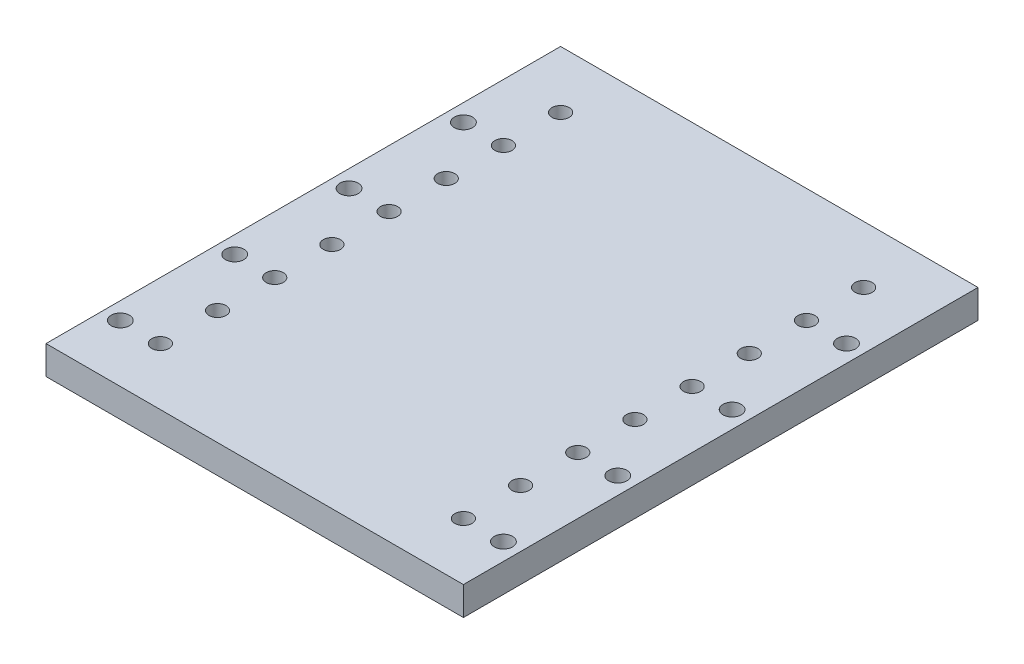
ISO-10303-21;
HEADER;
FILE_DESCRIPTION(('STEP AP214'),'2;1');
FILE_NAME('part.step','',(''),(''),'','','');
FILE_SCHEMA(('AUTOMOTIVE_DESIGN { 1 0 10303 214 1 1 1 1 }'));
ENDSEC;
DATA;
#1=APPLICATION_CONTEXT('core data for automotive mechanical design processes');
#2=APPLICATION_PROTOCOL_DEFINITION('international standard','automotive_design',2000,#1);
#3=PRODUCT_CONTEXT('',#1,'mechanical');
#4=PRODUCT('Part','Part','',(#3));
#5=PRODUCT_RELATED_PRODUCT_CATEGORY('part','',(#4));
#6=PRODUCT_DEFINITION_FORMATION('','',#4);
#7=PRODUCT_DEFINITION_CONTEXT('part definition',#1,'design');
#8=PRODUCT_DEFINITION('design','',#6,#7);
#9=PRODUCT_DEFINITION_SHAPE('','',#8);
#10=(LENGTH_UNIT() NAMED_UNIT(*) SI_UNIT(.MILLI.,.METRE.));
#11=(NAMED_UNIT(*) PLANE_ANGLE_UNIT() SI_UNIT($,.RADIAN.));
#12=(NAMED_UNIT(*) SI_UNIT($,.STERADIAN.) SOLID_ANGLE_UNIT());
#13=UNCERTAINTY_MEASURE_WITH_UNIT(LENGTH_MEASURE(1.E-05),#10,'distance_accuracy_value','');
#14=(GEOMETRIC_REPRESENTATION_CONTEXT(3) GLOBAL_UNCERTAINTY_ASSIGNED_CONTEXT((#13)) GLOBAL_UNIT_ASSIGNED_CONTEXT((#10,
#11,#12)) REPRESENTATION_CONTEXT('',''));
#15=CARTESIAN_POINT('',(0.,0.,0.));
#16=DIRECTION('',(0.,0.,1.));
#17=DIRECTION('',(1.,0.,0.));
#18=AXIS2_PLACEMENT_3D('',#15,#16,#17);
#19=CARTESIAN_POINT('',(36.5,5.,45.));
#20=DIRECTION('',(-1.,0.,0.));
#21=DIRECTION('',(0.,0.,1.));
#22=AXIS2_PLACEMENT_3D('',#19,#20,#21);
#23=PLANE('',#22);
#24=DIRECTION('',(0.,0.,-1.));
#25=VECTOR('',#24,1.);
#26=CARTESIAN_POINT('',(36.5,0.,45.));
#27=LINE('',#26,#25);
#28=CARTESIAN_POINT('',(36.5,0.,45.));
#29=VERTEX_POINT('',#28);
#30=CARTESIAN_POINT('',(36.5,0.,-45.));
#31=VERTEX_POINT('',#30);
#32=EDGE_CURVE('E109',#29,#31,#27,.T.);
#33=ORIENTED_EDGE('',*,*,#32,.T.);
#34=DIRECTION('',(0.,-1.,0.));
#35=VECTOR('',#34,1.);
#36=CARTESIAN_POINT('',(36.5,5.,-45.));
#37=LINE('',#36,#35);
#38=CARTESIAN_POINT('',(36.5,5.,-45.));
#39=VERTEX_POINT('',#38);
#40=EDGE_CURVE('E11',#39,#31,#37,.T.);
#41=ORIENTED_EDGE('',*,*,#40,.F.);
#42=DIRECTION('',(0.,0.,-1.));
#43=VECTOR('',#42,1.);
#44=CARTESIAN_POINT('',(36.5,5.,45.));
#45=LINE('',#44,#43);
#46=CARTESIAN_POINT('',(36.5,5.,45.));
#47=VERTEX_POINT('',#46);
#48=EDGE_CURVE('E92',#47,#39,#45,.T.);
#49=ORIENTED_EDGE('',*,*,#48,.F.);
#50=DIRECTION('',(0.,-1.,0.));
#51=VECTOR('',#50,1.);
#52=CARTESIAN_POINT('',(36.5,5.,45.));
#53=LINE('',#52,#51);
#54=EDGE_CURVE('E105',#47,#29,#53,.T.);
#55=ORIENTED_EDGE('',*,*,#54,.T.);
#56=EDGE_LOOP('',(#33,#41,#49,#55));
#57=FACE_BOUND('',#56,.T.);
#58=ADVANCED_FACE('F38',(#57),#23,.F.);
#59=CARTESIAN_POINT('',(-36.5,5.,-45.));
#60=DIRECTION('',(0.,0.,1.));
#61=DIRECTION('',(1.,0.,0.));
#62=AXIS2_PLACEMENT_3D('',#59,#60,#61);
#63=PLANE('',#62);
#64=DIRECTION('',(-1.,0.,0.));
#65=VECTOR('',#64,1.);
#66=CARTESIAN_POINT('',(-36.5,0.,-45.));
#67=LINE('',#66,#65);
#68=CARTESIAN_POINT('',(-36.5,0.,-45.));
#69=VERTEX_POINT('',#68);
#70=EDGE_CURVE('E97',#31,#69,#67,.T.);
#71=ORIENTED_EDGE('',*,*,#70,.T.);
#72=DIRECTION('',(0.,-1.,0.));
#73=VECTOR('',#72,1.);
#74=CARTESIAN_POINT('',(-36.5,5.,-45.));
#75=LINE('',#74,#73);
#76=CARTESIAN_POINT('',(-36.5,5.,-45.));
#77=VERTEX_POINT('',#76);
#78=EDGE_CURVE('E48',#77,#69,#75,.T.);
#79=ORIENTED_EDGE('',*,*,#78,.F.);
#80=DIRECTION('',(-1.,0.,0.));
#81=VECTOR('',#80,1.);
#82=CARTESIAN_POINT('',(-36.5,5.,-45.));
#83=LINE('',#82,#81);
#84=EDGE_CURVE('E87',#39,#77,#83,.T.);
#85=ORIENTED_EDGE('',*,*,#84,.F.);
#86=ORIENTED_EDGE('',*,*,#40,.T.);
#87=EDGE_LOOP('',(#71,#79,#85,#86));
#88=FACE_BOUND('',#87,.T.);
#89=ADVANCED_FACE('F96',(#88),#63,.F.);
#90=CARTESIAN_POINT('',(-36.5,5.,45.));
#91=DIRECTION('',(1.,0.,0.));
#92=DIRECTION('',(0.,0.,-1.));
#93=AXIS2_PLACEMENT_3D('',#90,#91,#92);
#94=PLANE('',#93);
#95=DIRECTION('',(0.,0.,1.));
#96=VECTOR('',#95,1.);
#97=CARTESIAN_POINT('',(-36.5,0.,45.));
#98=LINE('',#97,#96);
#99=CARTESIAN_POINT('',(-36.5,0.,45.));
#100=VERTEX_POINT('',#99);
#101=EDGE_CURVE('E74',#69,#100,#98,.T.);
#102=ORIENTED_EDGE('',*,*,#101,.T.);
#103=DIRECTION('',(0.,-1.,0.));
#104=VECTOR('',#103,1.);
#105=CARTESIAN_POINT('',(-36.5,5.,45.));
#106=LINE('',#105,#104);
#107=CARTESIAN_POINT('',(-36.5,5.,45.));
#108=VERTEX_POINT('',#107);
#109=EDGE_CURVE('E99',#108,#100,#106,.T.);
#110=ORIENTED_EDGE('',*,*,#109,.F.);
#111=DIRECTION('',(0.,0.,1.));
#112=VECTOR('',#111,1.);
#113=CARTESIAN_POINT('',(-36.5,5.,45.));
#114=LINE('',#113,#112);
#115=EDGE_CURVE('E90',#77,#108,#114,.T.);
#116=ORIENTED_EDGE('',*,*,#115,.F.);
#117=ORIENTED_EDGE('',*,*,#78,.T.);
#118=EDGE_LOOP('',(#102,#110,#116,#117));
#119=FACE_BOUND('',#118,.T.);
#120=ADVANCED_FACE('F101',(#119),#94,.F.);
#121=CARTESIAN_POINT('',(-36.5,5.,45.));
#122=DIRECTION('',(0.,0.,-1.));
#123=DIRECTION('',(-1.,0.,0.));
#124=AXIS2_PLACEMENT_3D('',#121,#122,#123);
#125=PLANE('',#124);
#126=DIRECTION('',(1.,0.,0.));
#127=VECTOR('',#126,1.);
#128=CARTESIAN_POINT('',(-36.5,0.,45.));
#129=LINE('',#128,#127);
#130=EDGE_CURVE('E80',#100,#29,#129,.T.);
#131=ORIENTED_EDGE('',*,*,#130,.T.);
#132=ORIENTED_EDGE('',*,*,#54,.F.);
#133=DIRECTION('',(1.,0.,0.));
#134=VECTOR('',#133,1.);
#135=CARTESIAN_POINT('',(-36.5,5.,45.));
#136=LINE('',#135,#134);
#137=EDGE_CURVE('E57',#108,#47,#136,.T.);
#138=ORIENTED_EDGE('',*,*,#137,.F.);
#139=ORIENTED_EDGE('',*,*,#109,.T.);
#140=EDGE_LOOP('',(#131,#132,#138,#139));
#141=FACE_BOUND('',#140,.T.);
#142=ADVANCED_FACE('F327',(#141),#125,.F.);
#143=CARTESIAN_POINT('',(0.,5.,0.));
#144=DIRECTION('',(0.,-1.,0.));
#145=DIRECTION('',(0.,0.,-1.));
#146=AXIS2_PLACEMENT_3D('',#143,#144,#145);
#147=PLANE('',#146);
#148=CARTESIAN_POINT('',(26.5000000000002,5.,-15.));
#149=DIRECTION('',(0.,1.,0.));
#150=DIRECTION('',(0.,0.,1.));
#151=AXIS2_PLACEMENT_3D('',#148,#149,#150);
#152=CIRCLE('',#151,1.5);
#153=CARTESIAN_POINT('',(26.5000000000002,5.,-13.5));
#154=VERTEX_POINT('',#153);
#155=EDGE_CURVE('E261',#154,#154,#152,.T.);
#156=ORIENTED_EDGE('',*,*,#155,.F.);
#157=EDGE_LOOP('',(#156));
#158=FACE_BOUND('',#157,.T.);
#159=CARTESIAN_POINT('',(26.5,5.,-35.));
#160=DIRECTION('',(0.,1.,0.));
#161=DIRECTION('',(0.,0.,1.));
#162=AXIS2_PLACEMENT_3D('',#159,#160,#161);
#163=CIRCLE('',#162,1.5);
#164=CARTESIAN_POINT('',(26.5,5.,-33.5));
#165=VERTEX_POINT('',#164);
#166=EDGE_CURVE('E287',#165,#165,#163,.T.);
#167=ORIENTED_EDGE('',*,*,#166,.F.);
#168=EDGE_LOOP('',(#167));
#169=FACE_BOUND('',#168,.T.);
#170=CARTESIAN_POINT('',(26.5000000000003,5.,-5.));
#171=DIRECTION('',(0.,1.,0.));
#172=DIRECTION('',(0.,0.,1.));
#173=AXIS2_PLACEMENT_3D('',#170,#171,#172);
#174=CIRCLE('',#173,1.5);
#175=CARTESIAN_POINT('',(26.5000000000003,5.,-3.5));
#176=VERTEX_POINT('',#175);
#177=EDGE_CURVE('E283',#176,#176,#174,.T.);
#178=ORIENTED_EDGE('',*,*,#177,.F.);
#179=EDGE_LOOP('',(#178));
#180=FACE_BOUND('',#179,.T.);
#181=CARTESIAN_POINT('',(26.5000000000004,5.,5.));
#182=DIRECTION('',(0.,1.,0.));
#183=DIRECTION('',(0.,0.,1.));
#184=AXIS2_PLACEMENT_3D('',#181,#182,#183);
#185=CIRCLE('',#184,1.5);
#186=CARTESIAN_POINT('',(26.5000000000004,5.,6.50000000000001));
#187=VERTEX_POINT('',#186);
#188=EDGE_CURVE('E279',#187,#187,#185,.T.);
#189=ORIENTED_EDGE('',*,*,#188,.F.);
#190=EDGE_LOOP('',(#189));
#191=FACE_BOUND('',#190,.T.);
#192=CARTESIAN_POINT('',(26.5000000000005,5.,15.));
#193=DIRECTION('',(0.,1.,0.));
#194=DIRECTION('',(0.,0.,1.));
#195=AXIS2_PLACEMENT_3D('',#192,#193,#194);
#196=CIRCLE('',#195,1.5);
#197=CARTESIAN_POINT('',(26.5000000000005,5.,16.5));
#198=VERTEX_POINT('',#197);
#199=EDGE_CURVE('E275',#198,#198,#196,.T.);
#200=ORIENTED_EDGE('',*,*,#199,.F.);
#201=EDGE_LOOP('',(#200));
#202=FACE_BOUND('',#201,.T.);
#203=CARTESIAN_POINT('',(26.5000000000006,5.,25.));
#204=DIRECTION('',(0.,1.,0.));
#205=DIRECTION('',(0.,0.,1.));
#206=AXIS2_PLACEMENT_3D('',#203,#204,#205);
#207=CIRCLE('',#206,1.5);
#208=CARTESIAN_POINT('',(26.5000000000006,5.,26.5));
#209=VERTEX_POINT('',#208);
#210=EDGE_CURVE('E271',#209,#209,#207,.T.);
#211=ORIENTED_EDGE('',*,*,#210,.F.);
#212=EDGE_LOOP('',(#211));
#213=FACE_BOUND('',#212,.T.);
#214=CARTESIAN_POINT('',(26.5000000000007,5.,35.));
#215=DIRECTION('',(0.,1.,0.));
#216=DIRECTION('',(0.,0.,1.));
#217=AXIS2_PLACEMENT_3D('',#214,#215,#216);
#218=CIRCLE('',#217,1.5);
#219=CARTESIAN_POINT('',(26.5000000000007,5.,36.5));
#220=VERTEX_POINT('',#219);
#221=EDGE_CURVE('E266',#220,#220,#218,.T.);
#222=ORIENTED_EDGE('',*,*,#221,.F.);
#223=EDGE_LOOP('',(#222));
#224=FACE_BOUND('',#223,.T.);
#225=CARTESIAN_POINT('',(-26.5000000000007,5.,35.));
#226=DIRECTION('',(0.,1.,0.));
#227=DIRECTION('',(0.,0.,-1.));
#228=AXIS2_PLACEMENT_3D('',#225,#226,#227);
#229=CIRCLE('',#228,1.5);
#230=CARTESIAN_POINT('',(-26.5000000000007,5.,33.5));
#231=VERTEX_POINT('',#230);
#232=EDGE_CURVE('E262',#231,#231,#229,.T.);
#233=ORIENTED_EDGE('',*,*,#232,.F.);
#234=EDGE_LOOP('',(#233));
#235=FACE_BOUND('',#234,.T.);
#236=CARTESIAN_POINT('',(-26.5000000000006,5.,24.9999999999999));
#237=DIRECTION('',(0.,1.,0.));
#238=DIRECTION('',(0.,0.,-1.));
#239=AXIS2_PLACEMENT_3D('',#236,#237,#238);
#240=CIRCLE('',#239,1.5);
#241=CARTESIAN_POINT('',(-26.5000000000006,5.,23.4999999999999));
#242=VERTEX_POINT('',#241);
#243=EDGE_CURVE('E267',#242,#242,#240,.T.);
#244=ORIENTED_EDGE('',*,*,#243,.F.);
#245=EDGE_LOOP('',(#244));
#246=FACE_BOUND('',#245,.T.);
#247=CARTESIAN_POINT('',(-26.5000000000005,5.,15.));
#248=DIRECTION('',(0.,1.,0.));
#249=DIRECTION('',(0.,0.,-1.));
#250=AXIS2_PLACEMENT_3D('',#247,#248,#249);
#251=CIRCLE('',#250,1.5);
#252=CARTESIAN_POINT('',(-26.5000000000005,5.,13.5));
#253=VERTEX_POINT('',#252);
#254=EDGE_CURVE('E314',#253,#253,#251,.T.);
#255=ORIENTED_EDGE('',*,*,#254,.F.);
#256=EDGE_LOOP('',(#255));
#257=FACE_BOUND('',#256,.T.);
#258=CARTESIAN_POINT('',(-26.5000000000004,5.,4.99999999999998));
#259=DIRECTION('',(0.,1.,0.));
#260=DIRECTION('',(0.,0.,-1.));
#261=AXIS2_PLACEMENT_3D('',#258,#259,#260);
#262=CIRCLE('',#261,1.5);
#263=CARTESIAN_POINT('',(-26.5000000000004,5.,3.49999999999998));
#264=VERTEX_POINT('',#263);
#265=EDGE_CURVE('E310',#264,#264,#262,.T.);
#266=ORIENTED_EDGE('',*,*,#265,.F.);
#267=EDGE_LOOP('',(#266));
#268=FACE_BOUND('',#267,.T.);
#269=CARTESIAN_POINT('',(-26.5000000000003,5.,-5.00000000000002));
#270=DIRECTION('',(0.,1.,0.));
#271=DIRECTION('',(0.,0.,-1.));
#272=AXIS2_PLACEMENT_3D('',#269,#270,#271);
#273=CIRCLE('',#272,1.5);
#274=CARTESIAN_POINT('',(-26.5000000000003,5.,-6.50000000000003));
#275=VERTEX_POINT('',#274);
#276=EDGE_CURVE('E306',#275,#275,#273,.T.);
#277=ORIENTED_EDGE('',*,*,#276,.F.);
#278=EDGE_LOOP('',(#277));
#279=FACE_BOUND('',#278,.T.);
#280=CARTESIAN_POINT('',(-26.5000000000002,5.,-15.));
#281=DIRECTION('',(0.,1.,0.));
#282=DIRECTION('',(0.,0.,-1.));
#283=AXIS2_PLACEMENT_3D('',#280,#281,#282);
#284=CIRCLE('',#283,1.5);
#285=CARTESIAN_POINT('',(-26.5000000000002,5.,-16.5));
#286=VERTEX_POINT('',#285);
#287=EDGE_CURVE('E302',#286,#286,#284,.T.);
#288=ORIENTED_EDGE('',*,*,#287,.F.);
#289=EDGE_LOOP('',(#288));
#290=FACE_BOUND('',#289,.T.);
#291=CARTESIAN_POINT('',(-26.5000000000001,5.,-25.));
#292=DIRECTION('',(0.,1.,0.));
#293=DIRECTION('',(0.,0.,-1.));
#294=AXIS2_PLACEMENT_3D('',#291,#292,#293);
#295=CIRCLE('',#294,1.5);
#296=CARTESIAN_POINT('',(-26.5000000000001,5.,-26.5));
#297=VERTEX_POINT('',#296);
#298=EDGE_CURVE('E298',#297,#297,#295,.T.);
#299=ORIENTED_EDGE('',*,*,#298,.F.);
#300=EDGE_LOOP('',(#299));
#301=FACE_BOUND('',#300,.T.);
#302=CARTESIAN_POINT('',(-26.5,5.,-35.));
#303=DIRECTION('',(0.,1.,0.));
#304=DIRECTION('',(0.,0.,-1.));
#305=AXIS2_PLACEMENT_3D('',#302,#303,#304);
#306=CIRCLE('',#305,1.5);
#307=CARTESIAN_POINT('',(-26.5,5.,-36.5));
#308=VERTEX_POINT('',#307);
#309=EDGE_CURVE('E294',#308,#308,#306,.T.);
#310=ORIENTED_EDGE('',*,*,#309,.F.);
#311=EDGE_LOOP('',(#310));
#312=FACE_BOUND('',#311,.T.);
#313=CARTESIAN_POINT('',(26.5000000000001,5.,-25.));
#314=DIRECTION('',(0.,1.,0.));
#315=DIRECTION('',(0.,0.,1.));
#316=AXIS2_PLACEMENT_3D('',#313,#314,#315);
#317=CIRCLE('',#316,1.5);
#318=CARTESIAN_POINT('',(26.5000000000001,5.,-23.5));
#319=VERTEX_POINT('',#318);
#320=EDGE_CURVE('E129',#319,#319,#317,.T.);
#321=ORIENTED_EDGE('',*,*,#320,.F.);
#322=EDGE_LOOP('',(#321));
#323=FACE_BOUND('',#322,.T.);
#324=CARTESIAN_POINT('',(-33.5,5.,-5.));
#325=DIRECTION('',(0.,1.,0.));
#326=DIRECTION('',(0.,0.,1.));
#327=AXIS2_PLACEMENT_3D('',#324,#325,#326);
#328=CIRCLE('',#327,1.6);
#329=CARTESIAN_POINT('',(-33.5,5.,-3.4));
#330=VERTEX_POINT('',#329);
#331=EDGE_CURVE('E207',#330,#330,#328,.T.);
#332=ORIENTED_EDGE('',*,*,#331,.F.);
#333=EDGE_LOOP('',(#332));
#334=FACE_BOUND('',#333,.T.);
#335=CARTESIAN_POINT('',(-33.5,5.,15.));
#336=DIRECTION('',(0.,1.,0.));
#337=DIRECTION('',(0.,0.,1.));
#338=AXIS2_PLACEMENT_3D('',#335,#336,#337);
#339=CIRCLE('',#338,1.6);
#340=CARTESIAN_POINT('',(-33.5,5.,16.6));
#341=VERTEX_POINT('',#340);
#342=EDGE_CURVE('E215',#341,#341,#339,.T.);
#343=ORIENTED_EDGE('',*,*,#342,.F.);
#344=EDGE_LOOP('',(#343));
#345=FACE_BOUND('',#344,.T.);
#346=CARTESIAN_POINT('',(-33.5,5.,35.));
#347=DIRECTION('',(0.,1.,0.));
#348=DIRECTION('',(0.,0.,1.));
#349=AXIS2_PLACEMENT_3D('',#346,#347,#348);
#350=CIRCLE('',#349,1.6);
#351=CARTESIAN_POINT('',(-33.5,5.,36.6));
#352=VERTEX_POINT('',#351);
#353=EDGE_CURVE('E223',#352,#352,#350,.T.);
#354=ORIENTED_EDGE('',*,*,#353,.F.);
#355=EDGE_LOOP('',(#354));
#356=FACE_BOUND('',#355,.T.);
#357=CARTESIAN_POINT('',(33.5,5.,35.));
#358=DIRECTION('',(0.,1.,0.));
#359=DIRECTION('',(0.,0.,-1.));
#360=AXIS2_PLACEMENT_3D('',#357,#358,#359);
#361=CIRCLE('',#360,1.6);
#362=CARTESIAN_POINT('',(33.5,5.,33.4));
#363=VERTEX_POINT('',#362);
#364=EDGE_CURVE('E231',#363,#363,#361,.T.);
#365=ORIENTED_EDGE('',*,*,#364,.F.);
#366=EDGE_LOOP('',(#365));
#367=FACE_BOUND('',#366,.T.);
#368=CARTESIAN_POINT('',(33.5,5.,15.));
#369=DIRECTION('',(0.,1.,0.));
#370=DIRECTION('',(0.,0.,-1.));
#371=AXIS2_PLACEMENT_3D('',#368,#369,#370);
#372=CIRCLE('',#371,1.6);
#373=CARTESIAN_POINT('',(33.5,5.,13.4));
#374=VERTEX_POINT('',#373);
#375=EDGE_CURVE('E245',#374,#374,#372,.T.);
#376=ORIENTED_EDGE('',*,*,#375,.F.);
#377=EDGE_LOOP('',(#376));
#378=FACE_BOUND('',#377,.T.);
#379=CARTESIAN_POINT('',(33.5,5.,-5.00000000000001));
#380=DIRECTION('',(0.,1.,0.));
#381=DIRECTION('',(0.,0.,-1.));
#382=AXIS2_PLACEMENT_3D('',#379,#380,#381);
#383=CIRCLE('',#382,1.6);
#384=CARTESIAN_POINT('',(33.5,5.,-6.60000000000001));
#385=VERTEX_POINT('',#384);
#386=EDGE_CURVE('E198',#385,#385,#383,.T.);
#387=ORIENTED_EDGE('',*,*,#386,.F.);
#388=EDGE_LOOP('',(#387));
#389=FACE_BOUND('',#388,.T.);
#390=CARTESIAN_POINT('',(33.5,5.,-25.));
#391=DIRECTION('',(0.,1.,0.));
#392=DIRECTION('',(0.,0.,-1.));
#393=AXIS2_PLACEMENT_3D('',#390,#391,#392);
#394=CIRCLE('',#393,1.6);
#395=CARTESIAN_POINT('',(33.5,5.,-26.6));
#396=VERTEX_POINT('',#395);
#397=EDGE_CURVE('E187',#396,#396,#394,.T.);
#398=ORIENTED_EDGE('',*,*,#397,.F.);
#399=EDGE_LOOP('',(#398));
#400=FACE_BOUND('',#399,.T.);
#401=CARTESIAN_POINT('',(-33.5,5.,-25.));
#402=DIRECTION('',(0.,1.,0.));
#403=DIRECTION('',(0.,0.,1.));
#404=AXIS2_PLACEMENT_3D('',#401,#402,#403);
#405=CIRCLE('',#404,1.6);
#406=CARTESIAN_POINT('',(-33.5,5.,-23.4));
#407=VERTEX_POINT('',#406);
#408=EDGE_CURVE('E206',#407,#407,#405,.T.);
#409=ORIENTED_EDGE('',*,*,#408,.F.);
#410=EDGE_LOOP('',(#409));
#411=FACE_BOUND('',#410,.T.);
#412=ORIENTED_EDGE('',*,*,#48,.T.);
#413=ORIENTED_EDGE('',*,*,#84,.T.);
#414=ORIENTED_EDGE('',*,*,#115,.T.);
#415=ORIENTED_EDGE('',*,*,#137,.T.);
#416=EDGE_LOOP('',(#412,#413,#414,#415));
#417=FACE_BOUND('',#416,.T.);
#418=ADVANCED_FACE('F88',(#158,#169,#180,#191,#202,#213,#224,#235,#246,#257,#268,#279,#290,#301,
#312,#323,#334,#345,#356,#367,#378,#389,#400,#411,#417),#147,.F.);
#419=CARTESIAN_POINT('',(0.,0.,0.));
#420=DIRECTION('',(0.,-1.,0.));
#421=DIRECTION('',(0.,0.,-1.));
#422=AXIS2_PLACEMENT_3D('',#419,#420,#421);
#423=PLANE('',#422);
#424=CARTESIAN_POINT('',(26.5000000000002,0.,-15.));
#425=DIRECTION('',(0.,-1.,0.));
#426=DIRECTION('',(0.,0.,-1.));
#427=AXIS2_PLACEMENT_3D('',#424,#425,#426);
#428=CIRCLE('',#427,1.5);
#429=CARTESIAN_POINT('',(26.5000000000002,0.,-16.5));
#430=VERTEX_POINT('',#429);
#431=EDGE_CURVE('E41',#430,#430,#428,.T.);
#432=ORIENTED_EDGE('',*,*,#431,.F.);
#433=EDGE_LOOP('',(#432));
#434=FACE_BOUND('',#433,.T.);
#435=CARTESIAN_POINT('',(26.5,0.,-35.));
#436=DIRECTION('',(0.,-1.,0.));
#437=DIRECTION('',(0.,0.,-1.));
#438=AXIS2_PLACEMENT_3D('',#435,#436,#437);
#439=CIRCLE('',#438,1.5);
#440=CARTESIAN_POINT('',(26.5,0.,-36.5));
#441=VERTEX_POINT('',#440);
#442=EDGE_CURVE('E180',#441,#441,#439,.T.);
#443=ORIENTED_EDGE('',*,*,#442,.F.);
#444=EDGE_LOOP('',(#443));
#445=FACE_BOUND('',#444,.T.);
#446=CARTESIAN_POINT('',(26.5000000000003,0.,-5.));
#447=DIRECTION('',(0.,-1.,0.));
#448=DIRECTION('',(0.,0.,-1.));
#449=AXIS2_PLACEMENT_3D('',#446,#447,#448);
#450=CIRCLE('',#449,1.5);
#451=CARTESIAN_POINT('',(26.5000000000003,0.,-6.5));
#452=VERTEX_POINT('',#451);
#453=EDGE_CURVE('E177',#452,#452,#450,.T.);
#454=ORIENTED_EDGE('',*,*,#453,.F.);
#455=EDGE_LOOP('',(#454));
#456=FACE_BOUND('',#455,.T.);
#457=CARTESIAN_POINT('',(26.5000000000004,0.,5.));
#458=DIRECTION('',(0.,-1.,0.));
#459=DIRECTION('',(0.,0.,-1.));
#460=AXIS2_PLACEMENT_3D('',#457,#458,#459);
#461=CIRCLE('',#460,1.5);
#462=CARTESIAN_POINT('',(26.5000000000004,0.,3.5));
#463=VERTEX_POINT('',#462);
#464=EDGE_CURVE('E173',#463,#463,#461,.T.);
#465=ORIENTED_EDGE('',*,*,#464,.F.);
#466=EDGE_LOOP('',(#465));
#467=FACE_BOUND('',#466,.T.);
#468=CARTESIAN_POINT('',(26.5000000000005,0.,15.));
#469=DIRECTION('',(0.,-1.,0.));
#470=DIRECTION('',(0.,0.,-1.));
#471=AXIS2_PLACEMENT_3D('',#468,#469,#470);
#472=CIRCLE('',#471,1.5);
#473=CARTESIAN_POINT('',(26.5000000000005,0.,13.5));
#474=VERTEX_POINT('',#473);
#475=EDGE_CURVE('E169',#474,#474,#472,.T.);
#476=ORIENTED_EDGE('',*,*,#475,.F.);
#477=EDGE_LOOP('',(#476));
#478=FACE_BOUND('',#477,.T.);
#479=CARTESIAN_POINT('',(26.5000000000006,0.,25.));
#480=DIRECTION('',(0.,-1.,0.));
#481=DIRECTION('',(0.,0.,-1.));
#482=AXIS2_PLACEMENT_3D('',#479,#480,#481);
#483=CIRCLE('',#482,1.5);
#484=CARTESIAN_POINT('',(26.5000000000006,0.,23.5));
#485=VERTEX_POINT('',#484);
#486=EDGE_CURVE('E165',#485,#485,#483,.T.);
#487=ORIENTED_EDGE('',*,*,#486,.F.);
#488=EDGE_LOOP('',(#487));
#489=FACE_BOUND('',#488,.T.);
#490=CARTESIAN_POINT('',(26.5000000000007,0.,35.));
#491=DIRECTION('',(0.,-1.,0.));
#492=DIRECTION('',(0.,0.,-1.));
#493=AXIS2_PLACEMENT_3D('',#490,#491,#492);
#494=CIRCLE('',#493,1.5);
#495=CARTESIAN_POINT('',(26.5000000000007,0.,33.5));
#496=VERTEX_POINT('',#495);
#497=EDGE_CURVE('E161',#496,#496,#494,.T.);
#498=ORIENTED_EDGE('',*,*,#497,.F.);
#499=EDGE_LOOP('',(#498));
#500=FACE_BOUND('',#499,.T.);
#501=CARTESIAN_POINT('',(-26.5000000000007,0.,35.));
#502=DIRECTION('',(0.,-1.,0.));
#503=DIRECTION('',(0.,0.,-1.));
#504=AXIS2_PLACEMENT_3D('',#501,#502,#503);
#505=CIRCLE('',#504,1.5);
#506=CARTESIAN_POINT('',(-26.5000000000007,0.,33.5));
#507=VERTEX_POINT('',#506);
#508=EDGE_CURVE('E157',#507,#507,#505,.T.);
#509=ORIENTED_EDGE('',*,*,#508,.F.);
#510=EDGE_LOOP('',(#509));
#511=FACE_BOUND('',#510,.T.);
#512=CARTESIAN_POINT('',(-26.5000000000006,0.,24.9999999999999));
#513=DIRECTION('',(0.,-1.,0.));
#514=DIRECTION('',(0.,0.,-1.));
#515=AXIS2_PLACEMENT_3D('',#512,#513,#514);
#516=CIRCLE('',#515,1.5);
#517=CARTESIAN_POINT('',(-26.5000000000006,0.,23.4999999999999));
#518=VERTEX_POINT('',#517);
#519=EDGE_CURVE('E153',#518,#518,#516,.T.);
#520=ORIENTED_EDGE('',*,*,#519,.F.);
#521=EDGE_LOOP('',(#520));
#522=FACE_BOUND('',#521,.T.);
#523=CARTESIAN_POINT('',(-26.5000000000005,0.,15.));
#524=DIRECTION('',(0.,-1.,0.));
#525=DIRECTION('',(0.,0.,-1.));
#526=AXIS2_PLACEMENT_3D('',#523,#524,#525);
#527=CIRCLE('',#526,1.5);
#528=CARTESIAN_POINT('',(-26.5000000000005,0.,13.5));
#529=VERTEX_POINT('',#528);
#530=EDGE_CURVE('E149',#529,#529,#527,.T.);
#531=ORIENTED_EDGE('',*,*,#530,.F.);
#532=EDGE_LOOP('',(#531));
#533=FACE_BOUND('',#532,.T.);
#534=CARTESIAN_POINT('',(-26.5000000000004,0.,4.99999999999998));
#535=DIRECTION('',(0.,-1.,0.));
#536=DIRECTION('',(0.,0.,-1.));
#537=AXIS2_PLACEMENT_3D('',#534,#535,#536);
#538=CIRCLE('',#537,1.5);
#539=CARTESIAN_POINT('',(-26.5000000000004,0.,3.49999999999998));
#540=VERTEX_POINT('',#539);
#541=EDGE_CURVE('E145',#540,#540,#538,.T.);
#542=ORIENTED_EDGE('',*,*,#541,.F.);
#543=EDGE_LOOP('',(#542));
#544=FACE_BOUND('',#543,.T.);
#545=CARTESIAN_POINT('',(-26.5000000000003,0.,-5.00000000000002));
#546=DIRECTION('',(0.,-1.,0.));
#547=DIRECTION('',(0.,0.,-1.));
#548=AXIS2_PLACEMENT_3D('',#545,#546,#547);
#549=CIRCLE('',#548,1.5);
#550=CARTESIAN_POINT('',(-26.5000000000003,0.,-6.50000000000003));
#551=VERTEX_POINT('',#550);
#552=EDGE_CURVE('E141',#551,#551,#549,.T.);
#553=ORIENTED_EDGE('',*,*,#552,.F.);
#554=EDGE_LOOP('',(#553));
#555=FACE_BOUND('',#554,.T.);
#556=CARTESIAN_POINT('',(-26.5000000000002,0.,-15.));
#557=DIRECTION('',(0.,-1.,0.));
#558=DIRECTION('',(0.,0.,-1.));
#559=AXIS2_PLACEMENT_3D('',#556,#557,#558);
#560=CIRCLE('',#559,1.5);
#561=CARTESIAN_POINT('',(-26.5000000000002,0.,-16.5));
#562=VERTEX_POINT('',#561);
#563=EDGE_CURVE('E137',#562,#562,#560,.T.);
#564=ORIENTED_EDGE('',*,*,#563,.F.);
#565=EDGE_LOOP('',(#564));
#566=FACE_BOUND('',#565,.T.);
#567=CARTESIAN_POINT('',(-26.5000000000001,0.,-25.));
#568=DIRECTION('',(0.,-1.,0.));
#569=DIRECTION('',(0.,0.,-1.));
#570=AXIS2_PLACEMENT_3D('',#567,#568,#569);
#571=CIRCLE('',#570,1.5);
#572=CARTESIAN_POINT('',(-26.5000000000001,0.,-26.5));
#573=VERTEX_POINT('',#572);
#574=EDGE_CURVE('E133',#573,#573,#571,.T.);
#575=ORIENTED_EDGE('',*,*,#574,.F.);
#576=EDGE_LOOP('',(#575));
#577=FACE_BOUND('',#576,.T.);
#578=CARTESIAN_POINT('',(-26.5,0.,-35.));
#579=DIRECTION('',(0.,-1.,0.));
#580=DIRECTION('',(0.,0.,-1.));
#581=AXIS2_PLACEMENT_3D('',#578,#579,#580);
#582=CIRCLE('',#581,1.5);
#583=CARTESIAN_POINT('',(-26.5,0.,-36.5));
#584=VERTEX_POINT('',#583);
#585=EDGE_CURVE('E128',#584,#584,#582,.T.);
#586=ORIENTED_EDGE('',*,*,#585,.F.);
#587=EDGE_LOOP('',(#586));
#588=FACE_BOUND('',#587,.T.);
#589=CARTESIAN_POINT('',(26.5000000000001,0.,-25.));
#590=DIRECTION('',(0.,-1.,0.));
#591=DIRECTION('',(0.,0.,-1.));
#592=AXIS2_PLACEMENT_3D('',#589,#590,#591);
#593=CIRCLE('',#592,1.5);
#594=CARTESIAN_POINT('',(26.5000000000001,0.,-26.5));
#595=VERTEX_POINT('',#594);
#596=EDGE_CURVE('E124',#595,#595,#593,.T.);
#597=ORIENTED_EDGE('',*,*,#596,.F.);
#598=EDGE_LOOP('',(#597));
#599=FACE_BOUND('',#598,.T.);
#600=CARTESIAN_POINT('',(-33.5,0.,-5.));
#601=DIRECTION('',(0.,1.,0.));
#602=DIRECTION('',(0.,0.,1.));
#603=AXIS2_PLACEMENT_3D('',#600,#601,#602);
#604=CIRCLE('',#603,1.6);
#605=CARTESIAN_POINT('',(-33.5,0.,-3.4));
#606=VERTEX_POINT('',#605);
#607=EDGE_CURVE('E202',#606,#606,#604,.T.);
#608=ORIENTED_EDGE('',*,*,#607,.T.);
#609=EDGE_LOOP('',(#608));
#610=FACE_BOUND('',#609,.T.);
#611=CARTESIAN_POINT('',(-33.5,0.,15.));
#612=DIRECTION('',(0.,1.,0.));
#613=DIRECTION('',(0.,0.,1.));
#614=AXIS2_PLACEMENT_3D('',#611,#612,#613);
#615=CIRCLE('',#614,1.6);
#616=CARTESIAN_POINT('',(-33.5,0.,16.6));
#617=VERTEX_POINT('',#616);
#618=EDGE_CURVE('E211',#617,#617,#615,.T.);
#619=ORIENTED_EDGE('',*,*,#618,.T.);
#620=EDGE_LOOP('',(#619));
#621=FACE_BOUND('',#620,.T.);
#622=CARTESIAN_POINT('',(-33.5,0.,35.));
#623=DIRECTION('',(0.,1.,0.));
#624=DIRECTION('',(0.,0.,1.));
#625=AXIS2_PLACEMENT_3D('',#622,#623,#624);
#626=CIRCLE('',#625,1.6);
#627=CARTESIAN_POINT('',(-33.5,0.,36.6));
#628=VERTEX_POINT('',#627);
#629=EDGE_CURVE('E219',#628,#628,#626,.T.);
#630=ORIENTED_EDGE('',*,*,#629,.T.);
#631=EDGE_LOOP('',(#630));
#632=FACE_BOUND('',#631,.T.);
#633=CARTESIAN_POINT('',(33.5,0.,35.));
#634=DIRECTION('',(0.,1.,0.));
#635=DIRECTION('',(0.,0.,-1.));
#636=AXIS2_PLACEMENT_3D('',#633,#634,#635);
#637=CIRCLE('',#636,1.6);
#638=CARTESIAN_POINT('',(33.5,0.,33.4));
#639=VERTEX_POINT('',#638);
#640=EDGE_CURVE('E227',#639,#639,#637,.T.);
#641=ORIENTED_EDGE('',*,*,#640,.T.);
#642=EDGE_LOOP('',(#641));
#643=FACE_BOUND('',#642,.T.);
#644=CARTESIAN_POINT('',(33.5,0.,15.));
#645=DIRECTION('',(0.,1.,0.));
#646=DIRECTION('',(0.,0.,-1.));
#647=AXIS2_PLACEMENT_3D('',#644,#645,#646);
#648=CIRCLE('',#647,1.6);
#649=CARTESIAN_POINT('',(33.5,0.,13.4));
#650=VERTEX_POINT('',#649);
#651=EDGE_CURVE('E235',#650,#650,#648,.T.);
#652=ORIENTED_EDGE('',*,*,#651,.T.);
#653=EDGE_LOOP('',(#652));
#654=FACE_BOUND('',#653,.T.);
#655=CARTESIAN_POINT('',(33.5,0.,-5.00000000000001));
#656=DIRECTION('',(0.,1.,0.));
#657=DIRECTION('',(0.,0.,-1.));
#658=AXIS2_PLACEMENT_3D('',#655,#656,#657);
#659=CIRCLE('',#658,1.6);
#660=CARTESIAN_POINT('',(33.5,0.,-6.60000000000001));
#661=VERTEX_POINT('',#660);
#662=EDGE_CURVE('E249',#661,#661,#659,.T.);
#663=ORIENTED_EDGE('',*,*,#662,.T.);
#664=EDGE_LOOP('',(#663));
#665=FACE_BOUND('',#664,.T.);
#666=CARTESIAN_POINT('',(33.5,0.,-25.));
#667=DIRECTION('',(0.,1.,0.));
#668=DIRECTION('',(0.,0.,-1.));
#669=AXIS2_PLACEMENT_3D('',#666,#667,#668);
#670=CIRCLE('',#669,1.6);
#671=CARTESIAN_POINT('',(33.5,0.,-26.6));
#672=VERTEX_POINT('',#671);
#673=EDGE_CURVE('E192',#672,#672,#670,.T.);
#674=ORIENTED_EDGE('',*,*,#673,.T.);
#675=EDGE_LOOP('',(#674));
#676=FACE_BOUND('',#675,.T.);
#677=CARTESIAN_POINT('',(-33.5,0.,-25.));
#678=DIRECTION('',(0.,1.,0.));
#679=DIRECTION('',(0.,0.,1.));
#680=AXIS2_PLACEMENT_3D('',#677,#678,#679);
#681=CIRCLE('',#680,1.6);
#682=CARTESIAN_POINT('',(-33.5,0.,-23.4));
#683=VERTEX_POINT('',#682);
#684=EDGE_CURVE('E113',#683,#683,#681,.T.);
#685=ORIENTED_EDGE('',*,*,#684,.T.);
#686=EDGE_LOOP('',(#685));
#687=FACE_BOUND('',#686,.T.);
#688=ORIENTED_EDGE('',*,*,#32,.F.);
#689=ORIENTED_EDGE('',*,*,#130,.F.);
#690=ORIENTED_EDGE('',*,*,#101,.F.);
#691=ORIENTED_EDGE('',*,*,#70,.F.);
#692=EDGE_LOOP('',(#688,#689,#690,#691));
#693=FACE_BOUND('',#692,.T.);
#694=ADVANCED_FACE('F326',(#434,#445,#456,#467,#478,#489,#500,#511,#522,#533,#544,#555,#566,
#577,#588,#599,#610,#621,#632,#643,#654,#665,#676,#687,#693),#423,.T.);
#695=CARTESIAN_POINT('',(-33.5,0.,-25.));
#696=DIRECTION('',(0.,1.,0.));
#697=DIRECTION('',(0.,0.,1.));
#698=AXIS2_PLACEMENT_3D('',#695,#696,#697);
#699=CYLINDRICAL_SURFACE('',#698,1.6);
#700=ORIENTED_EDGE('',*,*,#684,.F.);
#701=EDGE_LOOP('',(#700));
#702=FACE_BOUND('',#701,.T.);
#703=ORIENTED_EDGE('',*,*,#408,.T.);
#704=EDGE_LOOP('',(#703));
#705=FACE_BOUND('',#704,.T.);
#706=ADVANCED_FACE('F358',(#702,#705),#699,.F.);
#707=CARTESIAN_POINT('',(33.5,0.,-25.));
#708=DIRECTION('',(0.,1.,0.));
#709=DIRECTION('',(0.,0.,1.));
#710=AXIS2_PLACEMENT_3D('',#707,#708,#709);
#711=CYLINDRICAL_SURFACE('',#710,1.6);
#712=ORIENTED_EDGE('',*,*,#673,.F.);
#713=EDGE_LOOP('',(#712));
#714=FACE_BOUND('',#713,.T.);
#715=ORIENTED_EDGE('',*,*,#397,.T.);
#716=EDGE_LOOP('',(#715));
#717=FACE_BOUND('',#716,.T.);
#718=ADVANCED_FACE('F360',(#714,#717),#711,.F.);
#719=CARTESIAN_POINT('',(33.5,0.,-5.00000000000001));
#720=DIRECTION('',(0.,1.,0.));
#721=DIRECTION('',(0.,0.,1.));
#722=AXIS2_PLACEMENT_3D('',#719,#720,#721);
#723=CYLINDRICAL_SURFACE('',#722,1.6);
#724=ORIENTED_EDGE('',*,*,#662,.F.);
#725=EDGE_LOOP('',(#724));
#726=FACE_BOUND('',#725,.T.);
#727=ORIENTED_EDGE('',*,*,#386,.T.);
#728=EDGE_LOOP('',(#727));
#729=FACE_BOUND('',#728,.T.);
#730=ADVANCED_FACE('F367',(#726,#729),#723,.F.);
#731=CARTESIAN_POINT('',(33.5,0.,15.));
#732=DIRECTION('',(0.,1.,0.));
#733=DIRECTION('',(0.,0.,1.));
#734=AXIS2_PLACEMENT_3D('',#731,#732,#733);
#735=CYLINDRICAL_SURFACE('',#734,1.6);
#736=ORIENTED_EDGE('',*,*,#651,.F.);
#737=EDGE_LOOP('',(#736));
#738=FACE_BOUND('',#737,.T.);
#739=ORIENTED_EDGE('',*,*,#375,.T.);
#740=EDGE_LOOP('',(#739));
#741=FACE_BOUND('',#740,.T.);
#742=ADVANCED_FACE('F432',(#738,#741),#735,.F.);
#743=CARTESIAN_POINT('',(33.5,0.,35.));
#744=DIRECTION('',(0.,1.,0.));
#745=DIRECTION('',(0.,0.,1.));
#746=AXIS2_PLACEMENT_3D('',#743,#744,#745);
#747=CYLINDRICAL_SURFACE('',#746,1.6);
#748=ORIENTED_EDGE('',*,*,#640,.F.);
#749=EDGE_LOOP('',(#748));
#750=FACE_BOUND('',#749,.T.);
#751=ORIENTED_EDGE('',*,*,#364,.T.);
#752=EDGE_LOOP('',(#751));
#753=FACE_BOUND('',#752,.T.);
#754=ADVANCED_FACE('F441',(#750,#753),#747,.F.);
#755=CARTESIAN_POINT('',(-33.5,0.,35.));
#756=DIRECTION('',(0.,1.,0.));
#757=DIRECTION('',(0.,0.,1.));
#758=AXIS2_PLACEMENT_3D('',#755,#756,#757);
#759=CYLINDRICAL_SURFACE('',#758,1.6);
#760=ORIENTED_EDGE('',*,*,#629,.F.);
#761=EDGE_LOOP('',(#760));
#762=FACE_BOUND('',#761,.T.);
#763=ORIENTED_EDGE('',*,*,#353,.T.);
#764=EDGE_LOOP('',(#763));
#765=FACE_BOUND('',#764,.T.);
#766=ADVANCED_FACE('F450',(#762,#765),#759,.F.);
#767=CARTESIAN_POINT('',(-33.5,0.,15.));
#768=DIRECTION('',(0.,1.,0.));
#769=DIRECTION('',(0.,0.,1.));
#770=AXIS2_PLACEMENT_3D('',#767,#768,#769);
#771=CYLINDRICAL_SURFACE('',#770,1.6);
#772=ORIENTED_EDGE('',*,*,#618,.F.);
#773=EDGE_LOOP('',(#772));
#774=FACE_BOUND('',#773,.T.);
#775=ORIENTED_EDGE('',*,*,#342,.T.);
#776=EDGE_LOOP('',(#775));
#777=FACE_BOUND('',#776,.T.);
#778=ADVANCED_FACE('F458',(#774,#777),#771,.F.);
#779=CARTESIAN_POINT('',(-33.5,0.,-5.));
#780=DIRECTION('',(0.,1.,0.));
#781=DIRECTION('',(0.,0.,1.));
#782=AXIS2_PLACEMENT_3D('',#779,#780,#781);
#783=CYLINDRICAL_SURFACE('',#782,1.6);
#784=ORIENTED_EDGE('',*,*,#607,.F.);
#785=EDGE_LOOP('',(#784));
#786=FACE_BOUND('',#785,.T.);
#787=ORIENTED_EDGE('',*,*,#331,.T.);
#788=EDGE_LOOP('',(#787));
#789=FACE_BOUND('',#788,.T.);
#790=ADVANCED_FACE('F467',(#786,#789),#783,.F.);
#791=CARTESIAN_POINT('',(26.5000000000001,-5.,-25.));
#792=DIRECTION('',(0.,1.,0.));
#793=DIRECTION('',(0.,0.,1.));
#794=AXIS2_PLACEMENT_3D('',#791,#792,#793);
#795=CYLINDRICAL_SURFACE('',#794,1.5);
#796=ORIENTED_EDGE('',*,*,#596,.T.);
#797=EDGE_LOOP('',(#796));
#798=FACE_BOUND('',#797,.T.);
#799=ORIENTED_EDGE('',*,*,#320,.T.);
#800=EDGE_LOOP('',(#799));
#801=FACE_BOUND('',#800,.T.);
#802=ADVANCED_FACE('F476',(#798,#801),#795,.F.);
#803=CARTESIAN_POINT('',(-26.5,-5.,-35.));
#804=DIRECTION('',(0.,1.,0.));
#805=DIRECTION('',(0.,0.,1.));
#806=AXIS2_PLACEMENT_3D('',#803,#804,#805);
#807=CYLINDRICAL_SURFACE('',#806,1.5);
#808=ORIENTED_EDGE('',*,*,#585,.T.);
#809=EDGE_LOOP('',(#808));
#810=FACE_BOUND('',#809,.T.);
#811=ORIENTED_EDGE('',*,*,#309,.T.);
#812=EDGE_LOOP('',(#811));
#813=FACE_BOUND('',#812,.T.);
#814=ADVANCED_FACE('F485',(#810,#813),#807,.F.);
#815=CARTESIAN_POINT('',(-26.5000000000001,-5.,-25.));
#816=DIRECTION('',(0.,1.,0.));
#817=DIRECTION('',(0.,0.,1.));
#818=AXIS2_PLACEMENT_3D('',#815,#816,#817);
#819=CYLINDRICAL_SURFACE('',#818,1.5);
#820=ORIENTED_EDGE('',*,*,#574,.T.);
#821=EDGE_LOOP('',(#820));
#822=FACE_BOUND('',#821,.T.);
#823=ORIENTED_EDGE('',*,*,#298,.T.);
#824=EDGE_LOOP('',(#823));
#825=FACE_BOUND('',#824,.T.);
#826=ADVANCED_FACE('F494',(#822,#825),#819,.F.);
#827=CARTESIAN_POINT('',(-26.5000000000002,-5.,-15.));
#828=DIRECTION('',(0.,1.,0.));
#829=DIRECTION('',(0.,0.,1.));
#830=AXIS2_PLACEMENT_3D('',#827,#828,#829);
#831=CYLINDRICAL_SURFACE('',#830,1.5);
#832=ORIENTED_EDGE('',*,*,#563,.T.);
#833=EDGE_LOOP('',(#832));
#834=FACE_BOUND('',#833,.T.);
#835=ORIENTED_EDGE('',*,*,#287,.T.);
#836=EDGE_LOOP('',(#835));
#837=FACE_BOUND('',#836,.T.);
#838=ADVANCED_FACE('F503',(#834,#837),#831,.F.);
#839=CARTESIAN_POINT('',(-26.5000000000003,-5.,-5.00000000000002));
#840=DIRECTION('',(0.,1.,0.));
#841=DIRECTION('',(0.,0.,1.));
#842=AXIS2_PLACEMENT_3D('',#839,#840,#841);
#843=CYLINDRICAL_SURFACE('',#842,1.5);
#844=ORIENTED_EDGE('',*,*,#552,.T.);
#845=EDGE_LOOP('',(#844));
#846=FACE_BOUND('',#845,.T.);
#847=ORIENTED_EDGE('',*,*,#276,.T.);
#848=EDGE_LOOP('',(#847));
#849=FACE_BOUND('',#848,.T.);
#850=ADVANCED_FACE('F512',(#846,#849),#843,.F.);
#851=CARTESIAN_POINT('',(-26.5000000000004,-5.,4.99999999999998));
#852=DIRECTION('',(0.,1.,0.));
#853=DIRECTION('',(0.,0.,1.));
#854=AXIS2_PLACEMENT_3D('',#851,#852,#853);
#855=CYLINDRICAL_SURFACE('',#854,1.5);
#856=ORIENTED_EDGE('',*,*,#541,.T.);
#857=EDGE_LOOP('',(#856));
#858=FACE_BOUND('',#857,.T.);
#859=ORIENTED_EDGE('',*,*,#265,.T.);
#860=EDGE_LOOP('',(#859));
#861=FACE_BOUND('',#860,.T.);
#862=ADVANCED_FACE('F521',(#858,#861),#855,.F.);
#863=CARTESIAN_POINT('',(-26.5000000000005,-5.,15.));
#864=DIRECTION('',(0.,1.,0.));
#865=DIRECTION('',(0.,0.,1.));
#866=AXIS2_PLACEMENT_3D('',#863,#864,#865);
#867=CYLINDRICAL_SURFACE('',#866,1.5);
#868=ORIENTED_EDGE('',*,*,#530,.T.);
#869=EDGE_LOOP('',(#868));
#870=FACE_BOUND('',#869,.T.);
#871=ORIENTED_EDGE('',*,*,#254,.T.);
#872=EDGE_LOOP('',(#871));
#873=FACE_BOUND('',#872,.T.);
#874=ADVANCED_FACE('F530',(#870,#873),#867,.F.);
#875=CARTESIAN_POINT('',(-26.5000000000006,-5.,24.9999999999999));
#876=DIRECTION('',(0.,1.,0.));
#877=DIRECTION('',(0.,0.,1.));
#878=AXIS2_PLACEMENT_3D('',#875,#876,#877);
#879=CYLINDRICAL_SURFACE('',#878,1.5);
#880=ORIENTED_EDGE('',*,*,#519,.T.);
#881=EDGE_LOOP('',(#880));
#882=FACE_BOUND('',#881,.T.);
#883=ORIENTED_EDGE('',*,*,#243,.T.);
#884=EDGE_LOOP('',(#883));
#885=FACE_BOUND('',#884,.T.);
#886=ADVANCED_FACE('F322',(#882,#885),#879,.F.);
#887=CARTESIAN_POINT('',(-26.5000000000007,-5.,35.));
#888=DIRECTION('',(0.,1.,0.));
#889=DIRECTION('',(0.,0.,1.));
#890=AXIS2_PLACEMENT_3D('',#887,#888,#889);
#891=CYLINDRICAL_SURFACE('',#890,1.5);
#892=ORIENTED_EDGE('',*,*,#508,.T.);
#893=EDGE_LOOP('',(#892));
#894=FACE_BOUND('',#893,.T.);
#895=ORIENTED_EDGE('',*,*,#232,.T.);
#896=EDGE_LOOP('',(#895));
#897=FACE_BOUND('',#896,.T.);
#898=ADVANCED_FACE('F547',(#894,#897),#891,.F.);
#899=CARTESIAN_POINT('',(26.5000000000007,-5.,35.));
#900=DIRECTION('',(0.,1.,0.));
#901=DIRECTION('',(0.,0.,1.));
#902=AXIS2_PLACEMENT_3D('',#899,#900,#901);
#903=CYLINDRICAL_SURFACE('',#902,1.5);
#904=ORIENTED_EDGE('',*,*,#497,.T.);
#905=EDGE_LOOP('',(#904));
#906=FACE_BOUND('',#905,.T.);
#907=ORIENTED_EDGE('',*,*,#221,.T.);
#908=EDGE_LOOP('',(#907));
#909=FACE_BOUND('',#908,.T.);
#910=ADVANCED_FACE('F556',(#906,#909),#903,.F.);
#911=CARTESIAN_POINT('',(26.5000000000006,-5.,25.));
#912=DIRECTION('',(0.,1.,0.));
#913=DIRECTION('',(0.,0.,1.));
#914=AXIS2_PLACEMENT_3D('',#911,#912,#913);
#915=CYLINDRICAL_SURFACE('',#914,1.5);
#916=ORIENTED_EDGE('',*,*,#486,.T.);
#917=EDGE_LOOP('',(#916));
#918=FACE_BOUND('',#917,.T.);
#919=ORIENTED_EDGE('',*,*,#210,.T.);
#920=EDGE_LOOP('',(#919));
#921=FACE_BOUND('',#920,.T.);
#922=ADVANCED_FACE('F565',(#918,#921),#915,.F.);
#923=CARTESIAN_POINT('',(26.5000000000005,-5.,15.));
#924=DIRECTION('',(0.,1.,0.));
#925=DIRECTION('',(0.,0.,1.));
#926=AXIS2_PLACEMENT_3D('',#923,#924,#925);
#927=CYLINDRICAL_SURFACE('',#926,1.5);
#928=ORIENTED_EDGE('',*,*,#475,.T.);
#929=EDGE_LOOP('',(#928));
#930=FACE_BOUND('',#929,.T.);
#931=ORIENTED_EDGE('',*,*,#199,.T.);
#932=EDGE_LOOP('',(#931));
#933=FACE_BOUND('',#932,.T.);
#934=ADVANCED_FACE('F574',(#930,#933),#927,.F.);
#935=CARTESIAN_POINT('',(26.5000000000004,-5.,5.));
#936=DIRECTION('',(0.,1.,0.));
#937=DIRECTION('',(0.,0.,1.));
#938=AXIS2_PLACEMENT_3D('',#935,#936,#937);
#939=CYLINDRICAL_SURFACE('',#938,1.5);
#940=ORIENTED_EDGE('',*,*,#464,.T.);
#941=EDGE_LOOP('',(#940));
#942=FACE_BOUND('',#941,.T.);
#943=ORIENTED_EDGE('',*,*,#188,.T.);
#944=EDGE_LOOP('',(#943));
#945=FACE_BOUND('',#944,.T.);
#946=ADVANCED_FACE('F583',(#942,#945),#939,.F.);
#947=CARTESIAN_POINT('',(26.5000000000003,-5.,-5.));
#948=DIRECTION('',(0.,1.,0.));
#949=DIRECTION('',(0.,0.,1.));
#950=AXIS2_PLACEMENT_3D('',#947,#948,#949);
#951=CYLINDRICAL_SURFACE('',#950,1.5);
#952=ORIENTED_EDGE('',*,*,#453,.T.);
#953=EDGE_LOOP('',(#952));
#954=FACE_BOUND('',#953,.T.);
#955=ORIENTED_EDGE('',*,*,#177,.T.);
#956=EDGE_LOOP('',(#955));
#957=FACE_BOUND('',#956,.T.);
#958=ADVANCED_FACE('F592',(#954,#957),#951,.F.);
#959=CARTESIAN_POINT('',(26.5,-5.,-35.));
#960=DIRECTION('',(0.,1.,0.));
#961=DIRECTION('',(0.,0.,1.));
#962=AXIS2_PLACEMENT_3D('',#959,#960,#961);
#963=CYLINDRICAL_SURFACE('',#962,1.5);
#964=ORIENTED_EDGE('',*,*,#442,.T.);
#965=EDGE_LOOP('',(#964));
#966=FACE_BOUND('',#965,.T.);
#967=ORIENTED_EDGE('',*,*,#166,.T.);
#968=EDGE_LOOP('',(#967));
#969=FACE_BOUND('',#968,.T.);
#970=ADVANCED_FACE('F601',(#966,#969),#963,.F.);
#971=CARTESIAN_POINT('',(26.5000000000002,-5.,-15.));
#972=DIRECTION('',(0.,1.,0.));
#973=DIRECTION('',(0.,0.,1.));
#974=AXIS2_PLACEMENT_3D('',#971,#972,#973);
#975=CYLINDRICAL_SURFACE('',#974,1.5);
#976=ORIENTED_EDGE('',*,*,#431,.T.);
#977=EDGE_LOOP('',(#976));
#978=FACE_BOUND('',#977,.T.);
#979=ORIENTED_EDGE('',*,*,#155,.T.);
#980=EDGE_LOOP('',(#979));
#981=FACE_BOUND('',#980,.T.);
#982=ADVANCED_FACE('F610',(#978,#981),#975,.F.);
#983=CLOSED_SHELL('',(#58,#89,#120,#142,#418,#694,#706,#718,#730,#742,#754,#766,#778,#790,#802,
#814,#826,#838,#850,#862,#874,#886,#898,#910,#922,#934,#946,#958,#970,#982));
#984=MANIFOLD_SOLID_BREP('B2',#983);
#985=ADVANCED_BREP_SHAPE_REPRESENTATION('',(#18,#984),#14);
#986=SHAPE_DEFINITION_REPRESENTATION(#9,#985);
ENDSEC;
END-ISO-10303-21;
